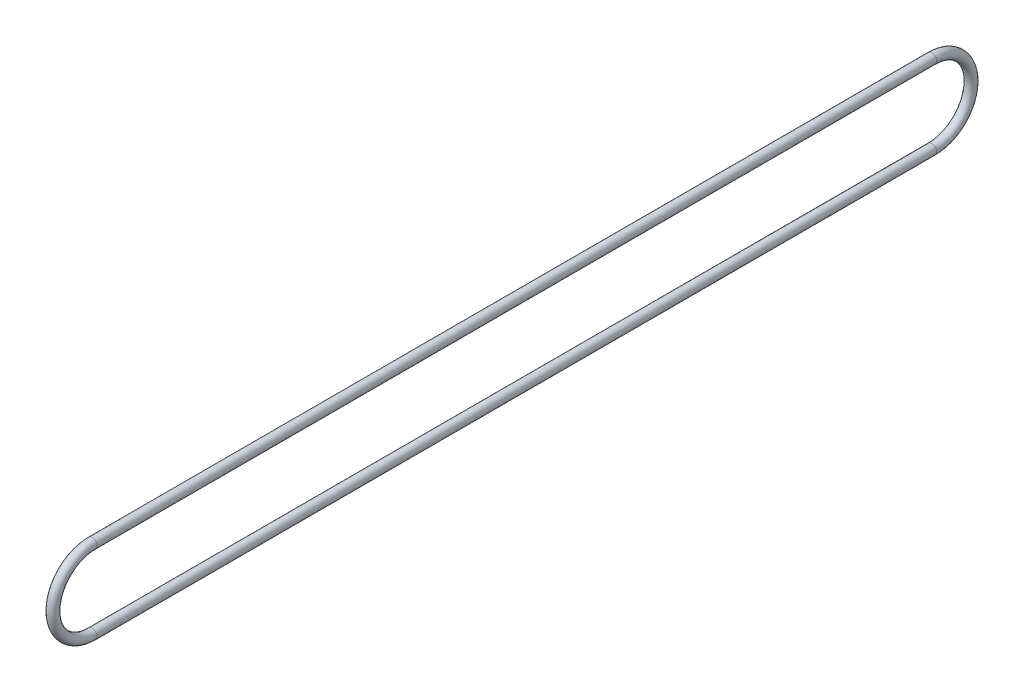
ISO-10303-21;
HEADER;
FILE_DESCRIPTION(('STEP AP214'),'2;1');
FILE_NAME('part.step','',(''),(''),'','','');
FILE_SCHEMA(('AUTOMOTIVE_DESIGN { 1 0 10303 214 1 1 1 1 }'));
ENDSEC;
DATA;
#1=APPLICATION_CONTEXT('core data for automotive mechanical design processes');
#2=APPLICATION_PROTOCOL_DEFINITION('international standard','automotive_design',2000,#1);
#3=PRODUCT_CONTEXT('',#1,'mechanical');
#4=PRODUCT('Part','Part','',(#3));
#5=PRODUCT_RELATED_PRODUCT_CATEGORY('part','',(#4));
#6=PRODUCT_DEFINITION_FORMATION('','',#4);
#7=PRODUCT_DEFINITION_CONTEXT('part definition',#1,'design');
#8=PRODUCT_DEFINITION('design','',#6,#7);
#9=PRODUCT_DEFINITION_SHAPE('','',#8);
#10=(LENGTH_UNIT() NAMED_UNIT(*) SI_UNIT(.MILLI.,.METRE.));
#11=(NAMED_UNIT(*) PLANE_ANGLE_UNIT() SI_UNIT($,.RADIAN.));
#12=(NAMED_UNIT(*) SI_UNIT($,.STERADIAN.) SOLID_ANGLE_UNIT());
#13=UNCERTAINTY_MEASURE_WITH_UNIT(LENGTH_MEASURE(1.E-05),#10,'distance_accuracy_value','');
#14=(GEOMETRIC_REPRESENTATION_CONTEXT(3) GLOBAL_UNCERTAINTY_ASSIGNED_CONTEXT((#13)) GLOBAL_UNIT_ASSIGNED_CONTEXT((#10,
#11,#12)) REPRESENTATION_CONTEXT('',''));
#15=CARTESIAN_POINT('',(0.,0.,0.));
#16=DIRECTION('',(0.,0.,1.));
#17=DIRECTION('',(1.,0.,0.));
#18=AXIS2_PLACEMENT_3D('',#15,#16,#17);
#19=CARTESIAN_POINT('',(0.,12.7,-271.4625));
#20=DIRECTION('',(0.,0.,1.));
#21=DIRECTION('',(1.,0.,0.));
#22=AXIS2_PLACEMENT_3D('',#19,#20,#21);
#23=CYLINDRICAL_SURFACE('',#22,1.5875);
#24=CARTESIAN_POINT('',(0.,12.7,0.));
#25=DIRECTION('',(0.,0.,1.));
#26=DIRECTION('',(1.,0.,0.));
#27=AXIS2_PLACEMENT_3D('',#24,#25,#26);
#28=CIRCLE('',#27,1.5875);
#29=CARTESIAN_POINT('',(0.,14.2875,0.));
#30=VERTEX_POINT('',#29);
#31=EDGE_CURVE('E45',#30,#30,#28,.T.);
#32=ORIENTED_EDGE('',*,*,#31,.F.);
#33=EDGE_LOOP('',(#32));
#34=FACE_BOUND('',#33,.T.);
#35=CARTESIAN_POINT('',(0.,12.7,-271.4625));
#36=DIRECTION('',(0.,0.,1.));
#37=DIRECTION('',(1.,0.,0.));
#38=AXIS2_PLACEMENT_3D('',#35,#36,#37);
#39=CIRCLE('',#38,1.5875);
#40=CARTESIAN_POINT('',(0.,14.2875,-271.4625));
#41=VERTEX_POINT('',#40);
#42=EDGE_CURVE('E10',#41,#41,#39,.T.);
#43=ORIENTED_EDGE('',*,*,#42,.T.);
#44=EDGE_LOOP('',(#43));
#45=FACE_BOUND('',#44,.T.);
#46=ADVANCED_FACE('F31',(#34,#45),#23,.T.);
#47=CARTESIAN_POINT('',(0.,0.,-271.4625));
#48=DIRECTION('',(1.,0.,0.));
#49=DIRECTION('',(0.,0.,-1.));
#50=AXIS2_PLACEMENT_3D('',#47,#48,#49);
#51=TOROIDAL_SURFACE('',#50,12.7,1.5875);
#52=CARTESIAN_POINT('',(0.,-12.7,-271.4625));
#53=DIRECTION('',(0.,0.,-1.));
#54=DIRECTION('',(1.,0.,0.));
#55=AXIS2_PLACEMENT_3D('',#52,#53,#54);
#56=CIRCLE('',#55,1.5875);
#57=CARTESIAN_POINT('',(0.,-14.2875,-271.4625));
#58=VERTEX_POINT('',#57);
#59=EDGE_CURVE('E37',#58,#58,#56,.T.);
#60=CARTESIAN_POINT('',(0.,0.,-271.4625));
#61=DIRECTION('',(1.,0.,0.));
#62=DIRECTION('',(0.,0.,-1.));
#63=AXIS2_PLACEMENT_3D('',#60,#61,#62);
#64=CIRCLE('',#63,14.2875);
#65=EDGE_CURVE('',#58,#41,#64,.T.);
#66=ORIENTED_EDGE('',*,*,#59,.T.);
#67=ORIENTED_EDGE('',*,*,#42,.F.);
#68=ORIENTED_EDGE('',*,*,#65,.T.);
#69=ORIENTED_EDGE('',*,*,#65,.F.);
#70=EDGE_LOOP('',(#66,#68,#67,#69));
#71=FACE_BOUND('',#70,.T.);
#72=ADVANCED_FACE('F54',(#71),#51,.T.);
#73=CARTESIAN_POINT('',(0.,-12.7,0.));
#74=DIRECTION('',(0.,0.,-1.));
#75=DIRECTION('',(-1.,0.,0.));
#76=AXIS2_PLACEMENT_3D('',#73,#74,#75);
#77=CYLINDRICAL_SURFACE('',#76,1.5875);
#78=ORIENTED_EDGE('',*,*,#59,.F.);
#79=EDGE_LOOP('',(#78));
#80=FACE_BOUND('',#79,.T.);
#81=CARTESIAN_POINT('',(0.,-12.7,0.));
#82=DIRECTION('',(0.,0.,-1.));
#83=DIRECTION('',(1.,0.,0.));
#84=AXIS2_PLACEMENT_3D('',#81,#82,#83);
#85=CIRCLE('',#84,1.5875);
#86=CARTESIAN_POINT('',(0.,-14.2875,0.));
#87=VERTEX_POINT('',#86);
#88=EDGE_CURVE('E41',#87,#87,#85,.T.);
#89=ORIENTED_EDGE('',*,*,#88,.T.);
#90=EDGE_LOOP('',(#89));
#91=FACE_BOUND('',#90,.T.);
#92=ADVANCED_FACE('F58',(#80,#91),#77,.T.);
#93=CARTESIAN_POINT('',(0.,0.,0.));
#94=DIRECTION('',(1.,0.,0.));
#95=DIRECTION('',(0.,0.,-1.));
#96=AXIS2_PLACEMENT_3D('',#93,#94,#95);
#97=TOROIDAL_SURFACE('',#96,12.7,1.5875);
#98=CARTESIAN_POINT('',(0.,0.,0.));
#99=DIRECTION('',(1.,0.,0.));
#100=DIRECTION('',(0.,0.,-1.));
#101=AXIS2_PLACEMENT_3D('',#98,#99,#100);
#102=CIRCLE('',#101,14.2875);
#103=EDGE_CURVE('',#30,#87,#102,.T.);
#104=ORIENTED_EDGE('',*,*,#31,.T.);
#105=ORIENTED_EDGE('',*,*,#88,.F.);
#106=ORIENTED_EDGE('',*,*,#103,.T.);
#107=ORIENTED_EDGE('',*,*,#103,.F.);
#108=EDGE_LOOP('',(#104,#106,#105,#107));
#109=FACE_BOUND('',#108,.T.);
#110=ADVANCED_FACE('F51',(#109),#97,.T.);
#111=CLOSED_SHELL('',(#46,#72,#92,#110));
#112=MANIFOLD_SOLID_BREP('B2',#111);
#113=ADVANCED_BREP_SHAPE_REPRESENTATION('',(#18,#112),#14);
#114=SHAPE_DEFINITION_REPRESENTATION(#9,#113);
ENDSEC;
END-ISO-10303-21;
